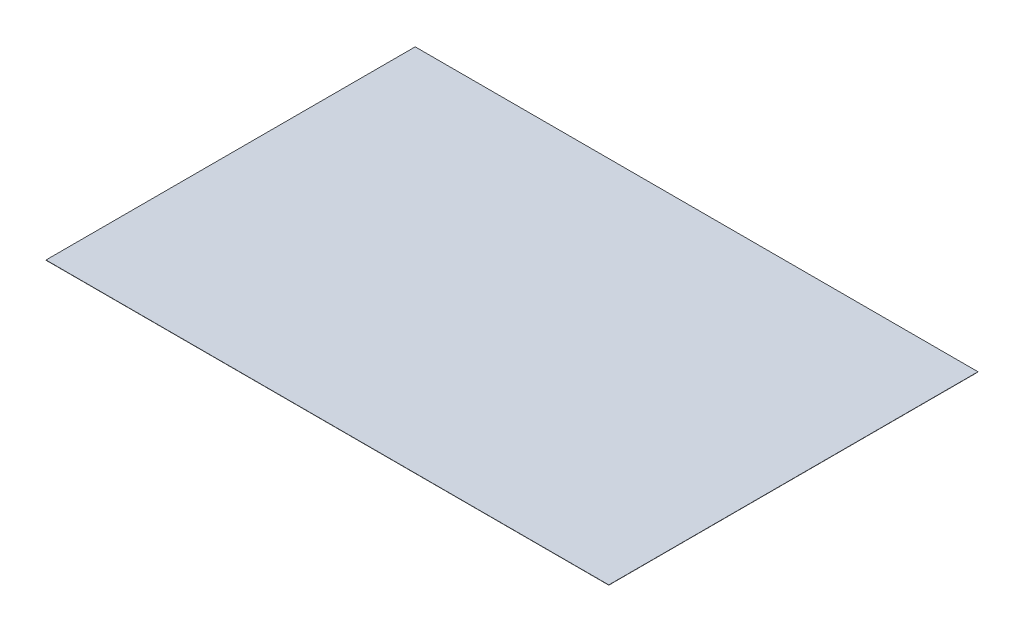
ISO-10303-21;
HEADER;
FILE_DESCRIPTION(('STEP AP214'),'2;1');
FILE_NAME('part.step','',(''),(''),'','','');
FILE_SCHEMA(('AUTOMOTIVE_DESIGN { 1 0 10303 214 1 1 1 1 }'));
ENDSEC;
DATA;
#1=APPLICATION_CONTEXT('core data for automotive mechanical design processes');
#2=APPLICATION_PROTOCOL_DEFINITION('international standard','automotive_design',2000,#1);
#3=PRODUCT_CONTEXT('',#1,'mechanical');
#4=PRODUCT('Part','Part','',(#3));
#5=PRODUCT_RELATED_PRODUCT_CATEGORY('part','',(#4));
#6=PRODUCT_DEFINITION_FORMATION('','',#4);
#7=PRODUCT_DEFINITION_CONTEXT('part definition',#1,'design');
#8=PRODUCT_DEFINITION('design','',#6,#7);
#9=PRODUCT_DEFINITION_SHAPE('','',#8);
#10=(LENGTH_UNIT() NAMED_UNIT(*) SI_UNIT(.MILLI.,.METRE.));
#11=(NAMED_UNIT(*) PLANE_ANGLE_UNIT() SI_UNIT($,.RADIAN.));
#12=(NAMED_UNIT(*) SI_UNIT($,.STERADIAN.) SOLID_ANGLE_UNIT());
#13=UNCERTAINTY_MEASURE_WITH_UNIT(LENGTH_MEASURE(1.E-05),#10,'distance_accuracy_value','');
#14=(GEOMETRIC_REPRESENTATION_CONTEXT(3) GLOBAL_UNCERTAINTY_ASSIGNED_CONTEXT((#13)) GLOBAL_UNIT_ASSIGNED_CONTEXT((#10,
#11,#12)) REPRESENTATION_CONTEXT('',''));
#15=CARTESIAN_POINT('',(0.,0.,0.));
#16=DIRECTION('',(0.,0.,1.));
#17=DIRECTION('',(1.,0.,0.));
#18=AXIS2_PLACEMENT_3D('',#15,#16,#17);
#19=CARTESIAN_POINT('',(250.,0.2,164.));
#20=DIRECTION('',(-1.,0.,0.));
#21=DIRECTION('',(0.,0.,1.));
#22=AXIS2_PLACEMENT_3D('',#19,#20,#21);
#23=PLANE('',#22);
#24=DIRECTION('',(0.,0.,-1.));
#25=VECTOR('',#24,1.);
#26=CARTESIAN_POINT('',(250.,0.,164.));
#27=LINE('',#26,#25);
#28=CARTESIAN_POINT('',(250.,0.,164.));
#29=VERTEX_POINT('',#28);
#30=CARTESIAN_POINT('',(250.,0.,-164.));
#31=VERTEX_POINT('',#30);
#32=EDGE_CURVE('E95',#29,#31,#27,.T.);
#33=ORIENTED_EDGE('',*,*,#32,.T.);
#34=DIRECTION('',(0.,-1.,0.));
#35=VECTOR('',#34,1.);
#36=CARTESIAN_POINT('',(250.,0.2,-164.));
#37=LINE('',#36,#35);
#38=CARTESIAN_POINT('',(250.,0.2,-164.));
#39=VERTEX_POINT('',#38);
#40=EDGE_CURVE('E11',#39,#31,#37,.T.);
#41=ORIENTED_EDGE('',*,*,#40,.F.);
#42=DIRECTION('',(0.,0.,-1.));
#43=VECTOR('',#42,1.);
#44=CARTESIAN_POINT('',(250.,0.2,164.));
#45=LINE('',#44,#43);
#46=CARTESIAN_POINT('',(250.,0.2,164.));
#47=VERTEX_POINT('',#46);
#48=EDGE_CURVE('E83',#47,#39,#45,.T.);
#49=ORIENTED_EDGE('',*,*,#48,.F.);
#50=DIRECTION('',(0.,-1.,0.));
#51=VECTOR('',#50,1.);
#52=CARTESIAN_POINT('',(250.,0.2,164.));
#53=LINE('',#52,#51);
#54=EDGE_CURVE('E91',#47,#29,#53,.T.);
#55=ORIENTED_EDGE('',*,*,#54,.T.);
#56=EDGE_LOOP('',(#33,#41,#49,#55));
#57=FACE_BOUND('',#56,.T.);
#58=ADVANCED_FACE('F32',(#57),#23,.F.);
#59=CARTESIAN_POINT('',(-250.,0.2,-164.));
#60=DIRECTION('',(0.,0.,1.));
#61=DIRECTION('',(1.,0.,0.));
#62=AXIS2_PLACEMENT_3D('',#59,#60,#61);
#63=PLANE('',#62);
#64=DIRECTION('',(-1.,0.,0.));
#65=VECTOR('',#64,1.);
#66=CARTESIAN_POINT('',(-250.,0.,-164.));
#67=LINE('',#66,#65);
#68=CARTESIAN_POINT('',(-250.,0.,-164.));
#69=VERTEX_POINT('',#68);
#70=EDGE_CURVE('E87',#31,#69,#67,.T.);
#71=ORIENTED_EDGE('',*,*,#70,.T.);
#72=DIRECTION('',(0.,-1.,0.));
#73=VECTOR('',#72,1.);
#74=CARTESIAN_POINT('',(-250.,0.2,-164.));
#75=LINE('',#74,#73);
#76=CARTESIAN_POINT('',(-250.,0.2,-164.));
#77=VERTEX_POINT('',#76);
#78=EDGE_CURVE('E40',#77,#69,#75,.T.);
#79=ORIENTED_EDGE('',*,*,#78,.F.);
#80=DIRECTION('',(-1.,0.,0.));
#81=VECTOR('',#80,1.);
#82=CARTESIAN_POINT('',(-250.,0.2,-164.));
#83=LINE('',#82,#81);
#84=EDGE_CURVE('E78',#39,#77,#83,.T.);
#85=ORIENTED_EDGE('',*,*,#84,.F.);
#86=ORIENTED_EDGE('',*,*,#40,.T.);
#87=EDGE_LOOP('',(#71,#79,#85,#86));
#88=FACE_BOUND('',#87,.T.);
#89=ADVANCED_FACE('F86',(#88),#63,.F.);
#90=CARTESIAN_POINT('',(-250.,0.2,164.));
#91=DIRECTION('',(1.,0.,0.));
#92=DIRECTION('',(0.,0.,-1.));
#93=AXIS2_PLACEMENT_3D('',#90,#91,#92);
#94=PLANE('',#93);
#95=DIRECTION('',(0.,0.,1.));
#96=VECTOR('',#95,1.);
#97=CARTESIAN_POINT('',(-250.,0.,164.));
#98=LINE('',#97,#96);
#99=CARTESIAN_POINT('',(-250.,0.,164.));
#100=VERTEX_POINT('',#99);
#101=EDGE_CURVE('E65',#69,#100,#98,.T.);
#102=ORIENTED_EDGE('',*,*,#101,.T.);
#103=DIRECTION('',(0.,-1.,0.));
#104=VECTOR('',#103,1.);
#105=CARTESIAN_POINT('',(-250.,0.2,164.));
#106=LINE('',#105,#104);
#107=CARTESIAN_POINT('',(-250.,0.2,164.));
#108=VERTEX_POINT('',#107);
#109=EDGE_CURVE('E88',#108,#100,#106,.T.);
#110=ORIENTED_EDGE('',*,*,#109,.F.);
#111=DIRECTION('',(0.,0.,1.));
#112=VECTOR('',#111,1.);
#113=CARTESIAN_POINT('',(-250.,0.2,164.));
#114=LINE('',#113,#112);
#115=EDGE_CURVE('E81',#77,#108,#114,.T.);
#116=ORIENTED_EDGE('',*,*,#115,.F.);
#117=ORIENTED_EDGE('',*,*,#78,.T.);
#118=EDGE_LOOP('',(#102,#110,#116,#117));
#119=FACE_BOUND('',#118,.T.);
#120=ADVANCED_FACE('F89',(#119),#94,.F.);
#121=CARTESIAN_POINT('',(-250.,0.2,164.));
#122=DIRECTION('',(0.,0.,-1.));
#123=DIRECTION('',(-1.,0.,0.));
#124=AXIS2_PLACEMENT_3D('',#121,#122,#123);
#125=PLANE('',#124);
#126=DIRECTION('',(1.,0.,0.));
#127=VECTOR('',#126,1.);
#128=CARTESIAN_POINT('',(-250.,0.,164.));
#129=LINE('',#128,#127);
#130=EDGE_CURVE('E71',#100,#29,#129,.T.);
#131=ORIENTED_EDGE('',*,*,#130,.T.);
#132=ORIENTED_EDGE('',*,*,#54,.F.);
#133=DIRECTION('',(1.,0.,0.));
#134=VECTOR('',#133,1.);
#135=CARTESIAN_POINT('',(-250.,0.2,164.));
#136=LINE('',#135,#134);
#137=EDGE_CURVE('E48',#108,#47,#136,.T.);
#138=ORIENTED_EDGE('',*,*,#137,.F.);
#139=ORIENTED_EDGE('',*,*,#109,.T.);
#140=EDGE_LOOP('',(#131,#132,#138,#139));
#141=FACE_BOUND('',#140,.T.);
#142=ADVANCED_FACE('F102',(#141),#125,.F.);
#143=CARTESIAN_POINT('',(0.,0.2,0.));
#144=DIRECTION('',(0.,-1.,0.));
#145=DIRECTION('',(0.,0.,-1.));
#146=AXIS2_PLACEMENT_3D('',#143,#144,#145);
#147=PLANE('',#146);
#148=ORIENTED_EDGE('',*,*,#48,.T.);
#149=ORIENTED_EDGE('',*,*,#84,.T.);
#150=ORIENTED_EDGE('',*,*,#115,.T.);
#151=ORIENTED_EDGE('',*,*,#137,.T.);
#152=EDGE_LOOP('',(#148,#149,#150,#151));
#153=FACE_BOUND('',#152,.T.);
#154=ADVANCED_FACE('F79',(#153),#147,.F.);
#155=CARTESIAN_POINT('',(0.,0.,0.));
#156=DIRECTION('',(0.,-1.,0.));
#157=DIRECTION('',(0.,0.,-1.));
#158=AXIS2_PLACEMENT_3D('',#155,#156,#157);
#159=PLANE('',#158);
#160=ORIENTED_EDGE('',*,*,#32,.F.);
#161=ORIENTED_EDGE('',*,*,#130,.F.);
#162=ORIENTED_EDGE('',*,*,#101,.F.);
#163=ORIENTED_EDGE('',*,*,#70,.F.);
#164=EDGE_LOOP('',(#160,#161,#162,#163));
#165=FACE_BOUND('',#164,.T.);
#166=ADVANCED_FACE('F105',(#165),#159,.T.);
#167=CLOSED_SHELL('',(#58,#89,#120,#142,#154,#166));
#168=MANIFOLD_SOLID_BREP('B2',#167);
#169=ADVANCED_BREP_SHAPE_REPRESENTATION('',(#18,#168),#14);
#170=SHAPE_DEFINITION_REPRESENTATION(#9,#169);
ENDSEC;
END-ISO-10303-21;
